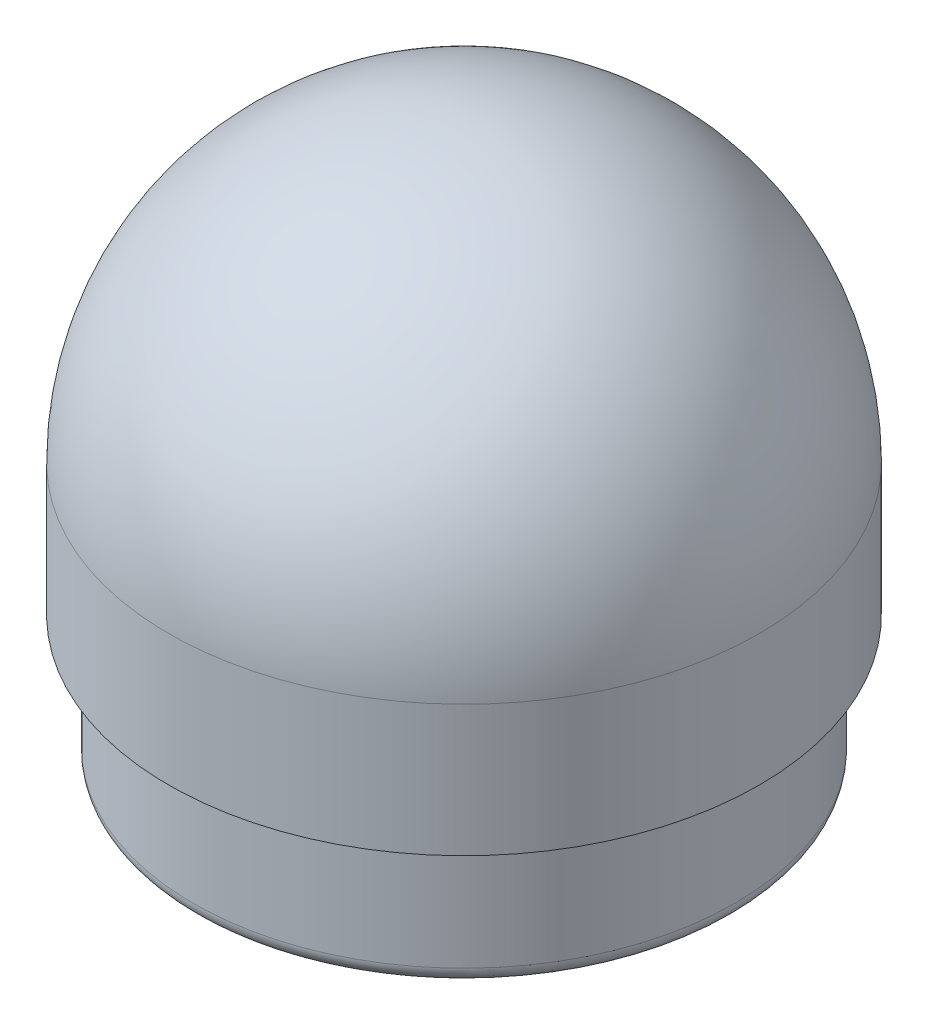
ISO-10303-21;
HEADER;
FILE_DESCRIPTION(('STEP AP214'),'2;1');
FILE_NAME('part.step','',(''),(''),'','','');
FILE_SCHEMA(('AUTOMOTIVE_DESIGN { 1 0 10303 214 1 1 1 1 }'));
ENDSEC;
DATA;
#1=APPLICATION_CONTEXT('core data for automotive mechanical design processes');
#2=APPLICATION_PROTOCOL_DEFINITION('international standard','automotive_design',2000,#1);
#3=PRODUCT_CONTEXT('',#1,'mechanical');
#4=PRODUCT('Part','Part','',(#3));
#5=PRODUCT_RELATED_PRODUCT_CATEGORY('part','',(#4));
#6=PRODUCT_DEFINITION_FORMATION('','',#4);
#7=PRODUCT_DEFINITION_CONTEXT('part definition',#1,'design');
#8=PRODUCT_DEFINITION('design','',#6,#7);
#9=PRODUCT_DEFINITION_SHAPE('','',#8);
#10=(LENGTH_UNIT() NAMED_UNIT(*) SI_UNIT(.MILLI.,.METRE.));
#11=(NAMED_UNIT(*) PLANE_ANGLE_UNIT() SI_UNIT($,.RADIAN.));
#12=(NAMED_UNIT(*) SI_UNIT($,.STERADIAN.) SOLID_ANGLE_UNIT());
#13=UNCERTAINTY_MEASURE_WITH_UNIT(LENGTH_MEASURE(1.E-05),#10,'distance_accuracy_value','');
#14=(GEOMETRIC_REPRESENTATION_CONTEXT(3) GLOBAL_UNCERTAINTY_ASSIGNED_CONTEXT((#13)) GLOBAL_UNIT_ASSIGNED_CONTEXT((#10,
#11,#12)) REPRESENTATION_CONTEXT('',''));
#15=CARTESIAN_POINT('',(0.,0.,0.));
#16=DIRECTION('',(0.,0.,1.));
#17=DIRECTION('',(1.,0.,0.));
#18=AXIS2_PLACEMENT_3D('',#15,#16,#17);
#19=CARTESIAN_POINT('',(0.,107.95,0.));
#20=DIRECTION('',(0.,1.,0.));
#21=DIRECTION('',(-1.,0.,0.));
#22=AXIS2_PLACEMENT_3D('',#19,#20,#21);
#23=CYLINDRICAL_SURFACE('',#22,44.45);
#24=CARTESIAN_POINT('',(0.,0.,0.));
#25=DIRECTION('',(0.,1.,0.));
#26=DIRECTION('',(-1.,0.,0.));
#27=AXIS2_PLACEMENT_3D('',#24,#25,#26);
#28=CIRCLE('',#27,44.45);
#29=CARTESIAN_POINT('',(-44.45,0.,0.));
#30=VERTEX_POINT('',#29);
#31=EDGE_CURVE('E12',#30,#30,#28,.T.);
#32=ORIENTED_EDGE('',*,*,#31,.F.);
#33=EDGE_LOOP('',(#32));
#34=FACE_BOUND('',#33,.T.);
#35=CARTESIAN_POINT('',(0.,50.8,0.));
#36=DIRECTION('',(0.,1.,0.));
#37=DIRECTION('',(-1.,0.,0.));
#38=AXIS2_PLACEMENT_3D('',#35,#36,#37);
#39=CIRCLE('',#38,44.45);
#40=CARTESIAN_POINT('',(-44.45,50.8,0.));
#41=VERTEX_POINT('',#40);
#42=EDGE_CURVE('E67',#41,#41,#39,.T.);
#43=ORIENTED_EDGE('',*,*,#42,.T.);
#44=EDGE_LOOP('',(#43));
#45=FACE_BOUND('',#44,.T.);
#46=ADVANCED_FACE('F42',(#34,#45),#23,.F.);
#47=CARTESIAN_POINT('',(44.45,0.,0.));
#48=DIRECTION('',(0.,1.,0.));
#49=DIRECTION('',(-1.,0.,0.));
#50=AXIS2_PLACEMENT_3D('',#47,#48,#49);
#51=PLANE('',#50);
#52=CARTESIAN_POINT('',(0.,0.,0.));
#53=DIRECTION('',(0.,1.,0.));
#54=DIRECTION('',(-1.,0.,0.));
#55=AXIS2_PLACEMENT_3D('',#52,#53,#54);
#56=CIRCLE('',#55,49.2124999999999);
#57=CARTESIAN_POINT('',(-49.2124999999999,0.,0.));
#58=VERTEX_POINT('',#57);
#59=EDGE_CURVE('E48',#58,#58,#56,.T.);
#60=ORIENTED_EDGE('',*,*,#59,.F.);
#61=EDGE_LOOP('',(#60));
#62=FACE_BOUND('',#61,.T.);
#63=ORIENTED_EDGE('',*,*,#31,.T.);
#64=EDGE_LOOP('',(#63));
#65=FACE_BOUND('',#64,.T.);
#66=ADVANCED_FACE('F83',(#62,#65),#51,.F.);
#67=CARTESIAN_POINT('',(0.,3.17499999999999,0.));
#68=DIRECTION('',(0.,1.,0.));
#69=DIRECTION('',(-1.,0.,0.));
#70=AXIS2_PLACEMENT_3D('',#67,#68,#69);
#71=TOROIDAL_SURFACE('',#70,49.2125,3.175);
#72=CARTESIAN_POINT('',(0.,3.17500000000001,0.));
#73=DIRECTION('',(0.,1.,0.));
#74=DIRECTION('',(-1.,0.,0.));
#75=AXIS2_PLACEMENT_3D('',#72,#73,#74);
#76=CIRCLE('',#75,52.3875);
#77=CARTESIAN_POINT('',(-52.3875,3.175,0.));
#78=VERTEX_POINT('',#77);
#79=EDGE_CURVE('E52',#78,#78,#76,.T.);
#80=ORIENTED_EDGE('',*,*,#79,.F.);
#81=EDGE_LOOP('',(#80));
#82=FACE_BOUND('',#81,.T.);
#83=ORIENTED_EDGE('',*,*,#59,.T.);
#84=EDGE_LOOP('',(#83));
#85=FACE_BOUND('',#84,.T.);
#86=ADVANCED_FACE('F88',(#82,#85),#71,.T.);
#87=CARTESIAN_POINT('',(0.,107.95,0.));
#88=DIRECTION('',(0.,1.,0.));
#89=DIRECTION('',(-1.,0.,0.));
#90=AXIS2_PLACEMENT_3D('',#87,#88,#89);
#91=CYLINDRICAL_SURFACE('',#90,52.3875);
#92=CARTESIAN_POINT('',(0.,25.4,0.));
#93=DIRECTION('',(0.,1.,0.));
#94=DIRECTION('',(-1.,0.,0.));
#95=AXIS2_PLACEMENT_3D('',#92,#93,#94);
#96=CIRCLE('',#95,52.3875);
#97=CARTESIAN_POINT('',(-52.3875,25.4,0.));
#98=VERTEX_POINT('',#97);
#99=EDGE_CURVE('E56',#98,#98,#96,.T.);
#100=ORIENTED_EDGE('',*,*,#99,.F.);
#101=EDGE_LOOP('',(#100));
#102=FACE_BOUND('',#101,.T.);
#103=ORIENTED_EDGE('',*,*,#79,.T.);
#104=EDGE_LOOP('',(#103));
#105=FACE_BOUND('',#104,.T.);
#106=ADVANCED_FACE('F93',(#102,#105),#91,.T.);
#107=CARTESIAN_POINT('',(52.3875,25.4,0.));
#108=DIRECTION('',(0.,1.,0.));
#109=DIRECTION('',(-1.,0.,0.));
#110=AXIS2_PLACEMENT_3D('',#107,#108,#109);
#111=PLANE('',#110);
#112=CARTESIAN_POINT('',(0.,25.4,0.));
#113=DIRECTION('',(0.,1.,0.));
#114=DIRECTION('',(-1.,0.,0.));
#115=AXIS2_PLACEMENT_3D('',#112,#113,#114);
#116=CIRCLE('',#115,57.15);
#117=CARTESIAN_POINT('',(-57.15,25.4,0.));
#118=VERTEX_POINT('',#117);
#119=EDGE_CURVE('E61',#118,#118,#116,.T.);
#120=ORIENTED_EDGE('',*,*,#119,.F.);
#121=EDGE_LOOP('',(#120));
#122=FACE_BOUND('',#121,.T.);
#123=ORIENTED_EDGE('',*,*,#99,.T.);
#124=EDGE_LOOP('',(#123));
#125=FACE_BOUND('',#124,.T.);
#126=ADVANCED_FACE('F99',(#122,#125),#111,.F.);
#127=CARTESIAN_POINT('',(0.,107.95,0.));
#128=DIRECTION('',(0.,1.,0.));
#129=DIRECTION('',(-1.,0.,0.));
#130=AXIS2_PLACEMENT_3D('',#127,#128,#129);
#131=CYLINDRICAL_SURFACE('',#130,57.15);
#132=CARTESIAN_POINT('',(0.,50.8,0.));
#133=DIRECTION('',(0.,1.,0.));
#134=DIRECTION('',(-1.,0.,0.));
#135=AXIS2_PLACEMENT_3D('',#132,#133,#134);
#136=CIRCLE('',#135,57.15);
#137=CARTESIAN_POINT('',(-57.15,50.8,0.));
#138=VERTEX_POINT('',#137);
#139=EDGE_CURVE('E64',#138,#138,#136,.T.);
#140=ORIENTED_EDGE('',*,*,#139,.F.);
#141=EDGE_LOOP('',(#140));
#142=FACE_BOUND('',#141,.T.);
#143=ORIENTED_EDGE('',*,*,#119,.T.);
#144=EDGE_LOOP('',(#143));
#145=FACE_BOUND('',#144,.T.);
#146=ADVANCED_FACE('F79',(#142,#145),#131,.T.);
#147=CARTESIAN_POINT('',(0.,50.8,0.));
#148=DIRECTION('',(0.,1.,0.));
#149=DIRECTION('',(1.,0.,0.));
#150=AXIS2_PLACEMENT_3D('',#147,#148,#149);
#151=SPHERICAL_SURFACE('',#150,57.15);
#152=ORIENTED_EDGE('',*,*,#139,.T.);
#153=EDGE_LOOP('',(#152));
#154=FACE_BOUND('',#153,.T.);
#155=ADVANCED_FACE('F74',(#154),#151,.T.);
#156=CARTESIAN_POINT('',(0.,50.8,0.));
#157=DIRECTION('',(0.,1.,0.));
#158=DIRECTION('',(1.,0.,0.));
#159=AXIS2_PLACEMENT_3D('',#156,#157,#158);
#160=SPHERICAL_SURFACE('',#159,44.45);
#161=ORIENTED_EDGE('',*,*,#42,.F.);
#162=EDGE_LOOP('',(#161));
#163=FACE_BOUND('',#162,.T.);
#164=ADVANCED_FACE('F72',(#163),#160,.F.);
#165=CLOSED_SHELL('',(#46,#66,#86,#106,#126,#146,#155,#164));
#166=MANIFOLD_SOLID_BREP('B2',#165);
#167=ADVANCED_BREP_SHAPE_REPRESENTATION('',(#18,#166),#14);
#168=SHAPE_DEFINITION_REPRESENTATION(#9,#167);
ENDSEC;
END-ISO-10303-21;
